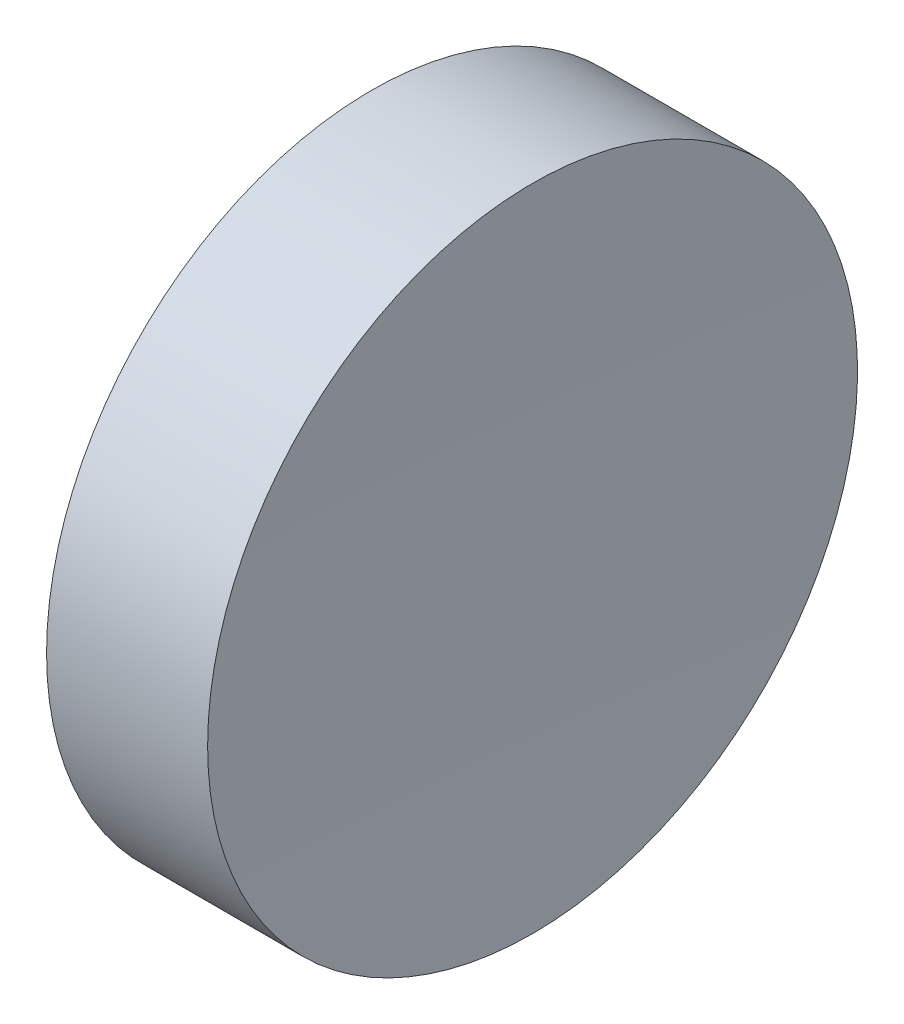
ISO-10303-21;
HEADER;
FILE_DESCRIPTION(('STEP AP214'),'2;1');
FILE_NAME('part.step','',(''),(''),'','','');
FILE_SCHEMA(('AUTOMOTIVE_DESIGN { 1 0 10303 214 1 1 1 1 }'));
ENDSEC;
DATA;
#1=APPLICATION_CONTEXT('core data for automotive mechanical design processes');
#2=APPLICATION_PROTOCOL_DEFINITION('international standard','automotive_design',2000,#1);
#3=PRODUCT_CONTEXT('',#1,'mechanical');
#4=PRODUCT('Part','Part','',(#3));
#5=PRODUCT_RELATED_PRODUCT_CATEGORY('part','',(#4));
#6=PRODUCT_DEFINITION_FORMATION('','',#4);
#7=PRODUCT_DEFINITION_CONTEXT('part definition',#1,'design');
#8=PRODUCT_DEFINITION('design','',#6,#7);
#9=PRODUCT_DEFINITION_SHAPE('','',#8);
#10=(LENGTH_UNIT() NAMED_UNIT(*) SI_UNIT(.MILLI.,.METRE.));
#11=(NAMED_UNIT(*) PLANE_ANGLE_UNIT() SI_UNIT($,.RADIAN.));
#12=(NAMED_UNIT(*) SI_UNIT($,.STERADIAN.) SOLID_ANGLE_UNIT());
#13=UNCERTAINTY_MEASURE_WITH_UNIT(LENGTH_MEASURE(1.E-05),#10,'distance_accuracy_value','');
#14=(GEOMETRIC_REPRESENTATION_CONTEXT(3) GLOBAL_UNCERTAINTY_ASSIGNED_CONTEXT((#13)) GLOBAL_UNIT_ASSIGNED_CONTEXT((#10,
#11,#12)) REPRESENTATION_CONTEXT('',''));
#15=CARTESIAN_POINT('',(0.,0.,0.));
#16=DIRECTION('',(0.,0.,1.));
#17=DIRECTION('',(1.,0.,0.));
#18=AXIS2_PLACEMENT_3D('',#15,#16,#17);
#19=CARTESIAN_POINT('',(521.092655540314,69.3780211233725,0.));
#20=DIRECTION('',(-1.,0.,0.));
#21=DIRECTION('',(0.,-1.,0.));
#22=AXIS2_PLACEMENT_3D('',#19,#20,#21);
#23=SPHERICAL_SURFACE('',#22,400.);
#24=CARTESIAN_POINT('',(121.288015747327,69.3780211233724,0.));
#25=DIRECTION('',(-1.,0.,0.));
#26=DIRECTION('',(0.,0.,1.));
#27=AXIS2_PLACEMENT_3D('',#24,#25,#26);
#28=CIRCLE('',#27,12.5);
#29=CARTESIAN_POINT('',(121.288015747327,69.3780211233724,12.5));
#30=VERTEX_POINT('',#29);
#31=EDGE_CURVE('E10',#30,#30,#28,.T.);
#32=ORIENTED_EDGE('',*,*,#31,.F.);
#33=EDGE_LOOP('',(#32));
#34=FACE_BOUND('',#33,.T.);
#35=ADVANCED_FACE('F35',(#34),#23,.F.);
#36=CARTESIAN_POINT('',(108.985143002165,69.3780211233724,0.));
#37=DIRECTION('',(-1.,0.,0.));
#38=DIRECTION('',(0.,0.,1.));
#39=AXIS2_PLACEMENT_3D('',#36,#37,#38);
#40=CYLINDRICAL_SURFACE('',#39,12.5);
#41=CARTESIAN_POINT('',(115.09265553492,69.3780211233724,0.));
#42=DIRECTION('',(-1.,0.,0.));
#43=DIRECTION('',(0.,0.,1.));
#44=AXIS2_PLACEMENT_3D('',#41,#42,#43);
#45=CIRCLE('',#44,12.5);
#46=CARTESIAN_POINT('',(115.09265553492,69.3780211233724,12.5));
#47=VERTEX_POINT('',#46);
#48=EDGE_CURVE('E41',#47,#47,#45,.T.);
#49=ORIENTED_EDGE('',*,*,#48,.F.);
#50=EDGE_LOOP('',(#49));
#51=FACE_BOUND('',#50,.T.);
#52=ORIENTED_EDGE('',*,*,#31,.T.);
#53=EDGE_LOOP('',(#52));
#54=FACE_BOUND('',#53,.T.);
#55=ADVANCED_FACE('F49',(#51,#54),#40,.T.);
#56=CARTESIAN_POINT('',(115.09265553492,69.3780211233724,0.));
#57=DIRECTION('',(1.,0.,0.));
#58=DIRECTION('',(0.,0.,-1.));
#59=AXIS2_PLACEMENT_3D('',#56,#57,#58);
#60=PLANE('',#59);
#61=ORIENTED_EDGE('',*,*,#48,.T.);
#62=EDGE_LOOP('',(#61));
#63=FACE_BOUND('',#62,.T.);
#64=ADVANCED_FACE('F47',(#63),#60,.F.);
#65=CLOSED_SHELL('',(#35,#55,#64));
#66=MANIFOLD_SOLID_BREP('B2',#65);
#67=ADVANCED_BREP_SHAPE_REPRESENTATION('',(#18,#66),#14);
#68=SHAPE_DEFINITION_REPRESENTATION(#9,#67);
ENDSEC;
END-ISO-10303-21;
